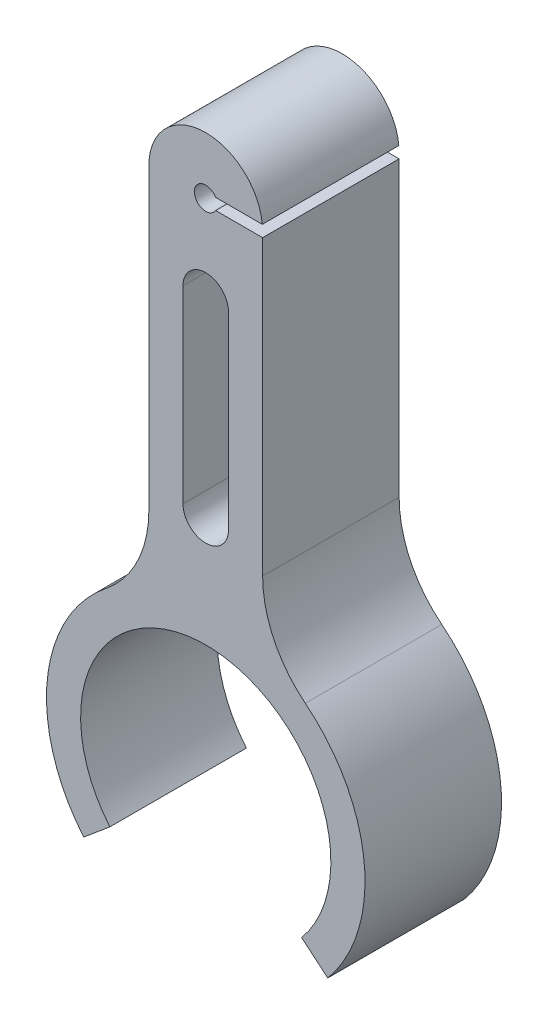
ISO-10303-21;
HEADER;
FILE_DESCRIPTION(('STEP AP214'),'2;1');
FILE_NAME('part.step','',(''),(''),'','','');
FILE_SCHEMA(('AUTOMOTIVE_DESIGN { 1 0 10303 214 1 1 1 1 }'));
ENDSEC;
DATA;
#1=APPLICATION_CONTEXT('core data for automotive mechanical design processes');
#2=APPLICATION_PROTOCOL_DEFINITION('international standard','automotive_design',2000,#1);
#3=PRODUCT_CONTEXT('',#1,'mechanical');
#4=PRODUCT('Part','Part','',(#3));
#5=PRODUCT_RELATED_PRODUCT_CATEGORY('part','',(#4));
#6=PRODUCT_DEFINITION_FORMATION('','',#4);
#7=PRODUCT_DEFINITION_CONTEXT('part definition',#1,'design');
#8=PRODUCT_DEFINITION('design','',#6,#7);
#9=PRODUCT_DEFINITION_SHAPE('','',#8);
#10=(LENGTH_UNIT() NAMED_UNIT(*) SI_UNIT(.MILLI.,.METRE.));
#11=(NAMED_UNIT(*) PLANE_ANGLE_UNIT() SI_UNIT($,.RADIAN.));
#12=(NAMED_UNIT(*) SI_UNIT($,.STERADIAN.) SOLID_ANGLE_UNIT());
#13=UNCERTAINTY_MEASURE_WITH_UNIT(LENGTH_MEASURE(1.E-05),#10,'distance_accuracy_value','');
#14=(GEOMETRIC_REPRESENTATION_CONTEXT(3) GLOBAL_UNCERTAINTY_ASSIGNED_CONTEXT((#13)) GLOBAL_UNIT_ASSIGNED_CONTEXT((#10,
#11,#12)) REPRESENTATION_CONTEXT('',''));
#15=CARTESIAN_POINT('',(0.,0.,0.));
#16=DIRECTION('',(0.,0.,1.));
#17=DIRECTION('',(1.,0.,0.));
#18=AXIS2_PLACEMENT_3D('',#15,#16,#17);
#19=CARTESIAN_POINT('',(0.,45.,12.));
#20=DIRECTION('',(0.,0.,-1.));
#21=DIRECTION('',(-1.,0.,0.));
#22=AXIS2_PLACEMENT_3D('',#19,#20,#21);
#23=CYLINDRICAL_SURFACE('',#22,2.);
#24=CARTESIAN_POINT('',(0.,45.,9.));
#25=DIRECTION('',(0.,0.,1.));
#26=DIRECTION('',(1.,0.,0.));
#27=AXIS2_PLACEMENT_3D('',#24,#25,#26);
#28=CIRCLE('',#27,2.);
#29=CARTESIAN_POINT('',(1.93649167310371,45.5,9.));
#30=VERTEX_POINT('',#29);
#31=CARTESIAN_POINT('',(1.93649167310371,44.5,9.));
#32=VERTEX_POINT('',#31);
#33=EDGE_CURVE('E201',#30,#32,#28,.T.);
#34=ORIENTED_EDGE('',*,*,#33,.T.);
#35=DIRECTION('',(0.,0.,-1.));
#36=VECTOR('',#35,1.);
#37=CARTESIAN_POINT('',(1.93649167310371,44.5,12.));
#38=LINE('',#37,#36);
#39=CARTESIAN_POINT('',(1.93649167310371,44.5,0.));
#40=VERTEX_POINT('',#39);
#41=EDGE_CURVE('E285',#32,#40,#38,.T.);
#42=ORIENTED_EDGE('',*,*,#41,.T.);
#43=CARTESIAN_POINT('',(0.,45.,0.));
#44=DIRECTION('',(0.,0.,1.));
#45=DIRECTION('',(1.,0.,0.));
#46=AXIS2_PLACEMENT_3D('',#43,#44,#45);
#47=CIRCLE('',#46,2.);
#48=CARTESIAN_POINT('',(1.93649167310371,45.5,0.));
#49=VERTEX_POINT('',#48);
#50=EDGE_CURVE('E210',#49,#40,#47,.T.);
#51=ORIENTED_EDGE('',*,*,#50,.F.);
#52=DIRECTION('',(0.,0.,-1.));
#53=VECTOR('',#52,1.);
#54=CARTESIAN_POINT('',(1.93649167310371,45.5,12.));
#55=LINE('',#54,#53);
#56=EDGE_CURVE('E170',#30,#49,#55,.T.);
#57=ORIENTED_EDGE('',*,*,#56,.F.);
#58=EDGE_LOOP('',(#34,#42,#51,#57));
#59=FACE_BOUND('',#58,.T.);
#60=ADVANCED_FACE('F35',(#59),#23,.F.);
#61=CARTESIAN_POINT('',(5.,0.,12.));
#62=DIRECTION('',(1.,0.,0.));
#63=DIRECTION('',(0.,0.,-1.));
#64=AXIS2_PLACEMENT_3D('',#61,#62,#63);
#65=PLANE('',#64);
#66=DIRECTION('',(0.,-1.,0.));
#67=VECTOR('',#66,1.);
#68=CARTESIAN_POINT('',(5.,0.,0.));
#69=LINE('',#68,#67);
#70=CARTESIAN_POINT('',(5.,44.5,0.));
#71=VERTEX_POINT('',#70);
#72=CARTESIAN_POINT('',(5.,18.7349939951952,0.));
#73=VERTEX_POINT('',#72);
#74=EDGE_CURVE('E227',#71,#73,#69,.T.);
#75=ORIENTED_EDGE('',*,*,#74,.F.);
#76=DIRECTION('',(0.,0.,1.));
#77=VECTOR('',#76,1.);
#78=CARTESIAN_POINT('',(5.,44.5,12.));
#79=LINE('',#78,#77);
#80=CARTESIAN_POINT('',(5.,44.5,12.));
#81=VERTEX_POINT('',#80);
#82=EDGE_CURVE('E288',#71,#81,#79,.T.);
#83=ORIENTED_EDGE('',*,*,#82,.T.);
#84=DIRECTION('',(0.,-1.,0.));
#85=VECTOR('',#84,1.);
#86=CARTESIAN_POINT('',(5.,0.,12.));
#87=LINE('',#86,#85);
#88=CARTESIAN_POINT('',(5.,18.7349939951952,12.));
#89=VERTEX_POINT('',#88);
#90=EDGE_CURVE('E189',#81,#89,#87,.T.);
#91=ORIENTED_EDGE('',*,*,#90,.T.);
#92=DIRECTION('',(0.,0.,-1.));
#93=VECTOR('',#92,1.);
#94=CARTESIAN_POINT('',(5.,18.7349939951952,12.));
#95=LINE('',#94,#93);
#96=EDGE_CURVE('E243',#89,#73,#95,.T.);
#97=ORIENTED_EDGE('',*,*,#96,.T.);
#98=EDGE_LOOP('',(#75,#83,#91,#97));
#99=FACE_BOUND('',#98,.T.);
#100=ADVANCED_FACE('F328',(#99),#65,.T.);
#101=CARTESIAN_POINT('',(0.,0.,12.));
#102=DIRECTION('',(0.,0.,1.));
#103=DIRECTION('',(1.,0.,0.));
#104=AXIS2_PLACEMENT_3D('',#101,#102,#103);
#105=PLANE('',#104);
#106=CARTESIAN_POINT('',(0.,20.7411148035419,12.));
#107=DIRECTION('',(0.,0.,1.));
#108=DIRECTION('',(1.,0.,0.));
#109=AXIS2_PLACEMENT_3D('',#106,#107,#108);
#110=CIRCLE('',#109,2.);
#111=CARTESIAN_POINT('',(-2.,20.7411148035419,12.));
#112=VERTEX_POINT('',#111);
#113=CARTESIAN_POINT('',(2.,20.7411148035419,12.));
#114=VERTEX_POINT('',#113);
#115=EDGE_CURVE('E231',#112,#114,#110,.T.);
#116=ORIENTED_EDGE('',*,*,#115,.F.);
#117=DIRECTION('',(0.,-1.,0.));
#118=VECTOR('',#117,1.);
#119=CARTESIAN_POINT('',(-2.,0.,12.));
#120=LINE('',#119,#118);
#121=CARTESIAN_POINT('',(-2.,37.3355820270801,12.));
#122=VERTEX_POINT('',#121);
#123=EDGE_CURVE('E296',#122,#112,#120,.T.);
#124=ORIENTED_EDGE('',*,*,#123,.F.);
#125=CARTESIAN_POINT('',(0.,37.3355820270801,12.));
#126=DIRECTION('',(0.,0.,1.));
#127=DIRECTION('',(1.,0.,0.));
#128=AXIS2_PLACEMENT_3D('',#125,#126,#127);
#129=CIRCLE('',#128,2.);
#130=CARTESIAN_POINT('',(2.,37.3355820270801,12.));
#131=VERTEX_POINT('',#130);
#132=EDGE_CURVE('E299',#131,#122,#129,.T.);
#133=ORIENTED_EDGE('',*,*,#132,.F.);
#134=DIRECTION('',(0.,-1.,0.));
#135=VECTOR('',#134,1.);
#136=CARTESIAN_POINT('',(2.,0.,12.));
#137=LINE('',#136,#135);
#138=EDGE_CURVE('E302',#131,#114,#137,.T.);
#139=ORIENTED_EDGE('',*,*,#138,.T.);
#140=EDGE_LOOP('',(#116,#124,#133,#139));
#141=FACE_BOUND('',#140,.T.);
#142=ORIENTED_EDGE('',*,*,#90,.F.);
#143=DIRECTION('',(-1.,0.,0.));
#144=VECTOR('',#143,1.);
#145=CARTESIAN_POINT('',(14.,44.5,12.));
#146=LINE('',#145,#144);
#147=CARTESIAN_POINT('',(0.866025403784439,44.5,12.));
#148=VERTEX_POINT('',#147);
#149=EDGE_CURVE('E182',#81,#148,#146,.T.);
#150=ORIENTED_EDGE('',*,*,#149,.T.);
#151=CARTESIAN_POINT('',(0.,45.,12.));
#152=DIRECTION('',(0.,0.,1.));
#153=DIRECTION('',(1.,0.,0.));
#154=AXIS2_PLACEMENT_3D('',#151,#152,#153);
#155=CIRCLE('',#154,1.);
#156=CARTESIAN_POINT('',(0.866025403784439,45.5,12.));
#157=VERTEX_POINT('',#156);
#158=EDGE_CURVE('E181',#157,#148,#155,.T.);
#159=ORIENTED_EDGE('',*,*,#158,.F.);
#160=DIRECTION('',(-1.,0.,0.));
#161=VECTOR('',#160,1.);
#162=CARTESIAN_POINT('',(14.,45.5,12.));
#163=LINE('',#162,#161);
#164=CARTESIAN_POINT('',(4.9749371855331,45.5,12.));
#165=VERTEX_POINT('',#164);
#166=EDGE_CURVE('E50',#165,#157,#163,.T.);
#167=ORIENTED_EDGE('',*,*,#166,.F.);
#168=CARTESIAN_POINT('',(0.,45.,12.));
#169=DIRECTION('',(0.,0.,1.));
#170=DIRECTION('',(1.,0.,0.));
#171=AXIS2_PLACEMENT_3D('',#168,#169,#170);
#172=CIRCLE('',#171,5.);
#173=CARTESIAN_POINT('',(-5.,45.,12.));
#174=VERTEX_POINT('',#173);
#175=EDGE_CURVE('E177',#165,#174,#172,.T.);
#176=ORIENTED_EDGE('',*,*,#175,.T.);
#177=DIRECTION('',(0.,-1.,0.));
#178=VECTOR('',#177,1.);
#179=CARTESIAN_POINT('',(-5.,0.,12.));
#180=LINE('',#179,#178);
#181=CARTESIAN_POINT('',(-5.,18.7349939951952,12.));
#182=VERTEX_POINT('',#181);
#183=EDGE_CURVE('E304',#174,#182,#180,.T.);
#184=ORIENTED_EDGE('',*,*,#183,.T.);
#185=CARTESIAN_POINT('',(-15.,18.7349939951952,12.));
#186=DIRECTION('',(0.,0.,1.));
#187=DIRECTION('',(1.,0.,0.));
#188=AXIS2_PLACEMENT_3D('',#185,#186,#187);
#189=CIRCLE('',#188,10.);
#190=CARTESIAN_POINT('',(-8.75,10.9287464971972,12.));
#191=VERTEX_POINT('',#190);
#192=EDGE_CURVE('E265',#182,#191,#189,.F.);
#193=ORIENTED_EDGE('',*,*,#192,.T.);
#194=CARTESIAN_POINT('',(0.,0.,12.));
#195=DIRECTION('',(0.,0.,1.));
#196=DIRECTION('',(1.,0.,0.));
#197=AXIS2_PLACEMENT_3D('',#194,#195,#196);
#198=CIRCLE('',#197,14.);
#199=CARTESIAN_POINT('',(-10.7246222036657,-8.99902653561153,12.));
#200=VERTEX_POINT('',#199);
#201=EDGE_CURVE('E306',#191,#200,#198,.T.);
#202=ORIENTED_EDGE('',*,*,#201,.T.);
#203=DIRECTION('',(-0.766044443118979,-0.642787609686538,0.));
#204=VECTOR('',#203,1.);
#205=CARTESIAN_POINT('',(0.,0.,12.));
#206=LINE('',#205,#204);
#207=CARTESIAN_POINT('',(-8.42648887430877,-7.07066370655192,12.));
#208=VERTEX_POINT('',#207);
#209=EDGE_CURVE('E308',#208,#200,#206,.T.);
#210=ORIENTED_EDGE('',*,*,#209,.F.);
#211=CARTESIAN_POINT('',(0.,0.,12.));
#212=DIRECTION('',(0.,0.,1.));
#213=DIRECTION('',(1.,0.,0.));
#214=AXIS2_PLACEMENT_3D('',#211,#212,#213);
#215=CIRCLE('',#214,11.);
#216=CARTESIAN_POINT('',(8.42648887430877,-7.07066370655192,12.));
#217=VERTEX_POINT('',#216);
#218=EDGE_CURVE('E311',#217,#208,#215,.T.);
#219=ORIENTED_EDGE('',*,*,#218,.F.);
#220=DIRECTION('',(0.766044443118979,-0.642787609686538,0.));
#221=VECTOR('',#220,1.);
#222=CARTESIAN_POINT('',(0.,0.,12.));
#223=LINE('',#222,#221);
#224=CARTESIAN_POINT('',(10.7246222036657,-8.99902653561153,12.));
#225=VERTEX_POINT('',#224);
#226=EDGE_CURVE('E313',#217,#225,#223,.T.);
#227=ORIENTED_EDGE('',*,*,#226,.T.);
#228=CARTESIAN_POINT('',(8.75,10.9287464971972,12.));
#229=VERTEX_POINT('',#228);
#230=EDGE_CURVE('E193',#225,#229,#198,.T.);
#231=ORIENTED_EDGE('',*,*,#230,.T.);
#232=CARTESIAN_POINT('',(15.,18.7349939951952,12.));
#233=DIRECTION('',(0.,0.,1.));
#234=DIRECTION('',(1.,0.,0.));
#235=AXIS2_PLACEMENT_3D('',#232,#233,#234);
#236=CIRCLE('',#235,10.);
#237=EDGE_CURVE('E260',#229,#89,#236,.F.);
#238=ORIENTED_EDGE('',*,*,#237,.T.);
#239=EDGE_LOOP('',(#142,#150,#159,#167,#176,#184,#193,#202,#210,#219,#227,#231,#238));
#240=FACE_BOUND('',#239,.T.);
#241=ADVANCED_FACE('F175',(#141,#240),#105,.T.);
#242=CARTESIAN_POINT('',(0.,0.,0.));
#243=DIRECTION('',(0.,0.,1.));
#244=DIRECTION('',(1.,0.,0.));
#245=AXIS2_PLACEMENT_3D('',#242,#243,#244);
#246=PLANE('',#245);
#247=CARTESIAN_POINT('',(0.,20.7411148035419,0.));
#248=DIRECTION('',(0.,0.,1.));
#249=DIRECTION('',(1.,0.,0.));
#250=AXIS2_PLACEMENT_3D('',#247,#248,#249);
#251=CIRCLE('',#250,2.);
#252=CARTESIAN_POINT('',(-2.,20.7411148035419,0.));
#253=VERTEX_POINT('',#252);
#254=CARTESIAN_POINT('',(2.,20.7411148035419,0.));
#255=VERTEX_POINT('',#254);
#256=EDGE_CURVE('E197',#253,#255,#251,.T.);
#257=ORIENTED_EDGE('',*,*,#256,.T.);
#258=DIRECTION('',(0.,-1.,0.));
#259=VECTOR('',#258,1.);
#260=CARTESIAN_POINT('',(2.,0.,0.));
#261=LINE('',#260,#259);
#262=CARTESIAN_POINT('',(2.,37.3355820270801,0.));
#263=VERTEX_POINT('',#262);
#264=EDGE_CURVE('E207',#263,#255,#261,.T.);
#265=ORIENTED_EDGE('',*,*,#264,.F.);
#266=CARTESIAN_POINT('',(0.,37.3355820270801,0.));
#267=DIRECTION('',(0.,0.,1.));
#268=DIRECTION('',(1.,0.,0.));
#269=AXIS2_PLACEMENT_3D('',#266,#267,#268);
#270=CIRCLE('',#269,2.);
#271=CARTESIAN_POINT('',(-2.,37.3355820270801,0.));
#272=VERTEX_POINT('',#271);
#273=EDGE_CURVE('E204',#263,#272,#270,.T.);
#274=ORIENTED_EDGE('',*,*,#273,.T.);
#275=DIRECTION('',(0.,-1.,0.));
#276=VECTOR('',#275,1.);
#277=CARTESIAN_POINT('',(-2.,0.,0.));
#278=LINE('',#277,#276);
#279=EDGE_CURVE('E200',#272,#253,#278,.T.);
#280=ORIENTED_EDGE('',*,*,#279,.T.);
#281=EDGE_LOOP('',(#257,#265,#274,#280));
#282=FACE_BOUND('',#281,.T.);
#283=DIRECTION('',(-1.,0.,0.));
#284=VECTOR('',#283,1.);
#285=CARTESIAN_POINT('',(14.,44.5,0.));
#286=LINE('',#285,#284);
#287=EDGE_CURVE('E278',#71,#40,#286,.T.);
#288=ORIENTED_EDGE('',*,*,#287,.F.);
#289=ORIENTED_EDGE('',*,*,#74,.T.);
#290=CARTESIAN_POINT('',(15.,18.7349939951952,0.));
#291=DIRECTION('',(0.,0.,1.));
#292=DIRECTION('',(1.,0.,0.));
#293=AXIS2_PLACEMENT_3D('',#290,#291,#292);
#294=CIRCLE('',#293,10.);
#295=CARTESIAN_POINT('',(8.75,10.9287464971972,0.));
#296=VERTEX_POINT('',#295);
#297=EDGE_CURVE('E258',#73,#296,#294,.T.);
#298=ORIENTED_EDGE('',*,*,#297,.T.);
#299=CARTESIAN_POINT('',(0.,0.,0.));
#300=DIRECTION('',(0.,0.,1.));
#301=DIRECTION('',(1.,0.,0.));
#302=AXIS2_PLACEMENT_3D('',#299,#300,#301);
#303=CIRCLE('',#302,14.);
#304=CARTESIAN_POINT('',(10.7246222036657,-8.99902653561153,0.));
#305=VERTEX_POINT('',#304);
#306=EDGE_CURVE('E219',#305,#296,#303,.T.);
#307=ORIENTED_EDGE('',*,*,#306,.F.);
#308=DIRECTION('',(0.766044443118979,-0.642787609686538,0.));
#309=VECTOR('',#308,1.);
#310=CARTESIAN_POINT('',(0.,0.,0.));
#311=LINE('',#310,#309);
#312=CARTESIAN_POINT('',(8.42648887430877,-7.07066370655192,0.));
#313=VERTEX_POINT('',#312);
#314=EDGE_CURVE('E225',#313,#305,#311,.T.);
#315=ORIENTED_EDGE('',*,*,#314,.F.);
#316=CARTESIAN_POINT('',(0.,0.,0.));
#317=DIRECTION('',(0.,0.,1.));
#318=DIRECTION('',(1.,0.,0.));
#319=AXIS2_PLACEMENT_3D('',#316,#317,#318);
#320=CIRCLE('',#319,11.);
#321=CARTESIAN_POINT('',(-8.42648887430877,-7.07066370655192,0.));
#322=VERTEX_POINT('',#321);
#323=EDGE_CURVE('E222',#313,#322,#320,.T.);
#324=ORIENTED_EDGE('',*,*,#323,.T.);
#325=DIRECTION('',(-0.766044443118979,-0.642787609686538,0.));
#326=VECTOR('',#325,1.);
#327=CARTESIAN_POINT('',(0.,0.,0.));
#328=LINE('',#327,#326);
#329=CARTESIAN_POINT('',(-10.7246222036657,-8.99902653561153,0.));
#330=VERTEX_POINT('',#329);
#331=EDGE_CURVE('E218',#322,#330,#328,.T.);
#332=ORIENTED_EDGE('',*,*,#331,.T.);
#333=CARTESIAN_POINT('',(-8.75,10.9287464971972,0.));
#334=VERTEX_POINT('',#333);
#335=EDGE_CURVE('E216',#334,#330,#303,.T.);
#336=ORIENTED_EDGE('',*,*,#335,.F.);
#337=CARTESIAN_POINT('',(-15.,18.7349939951952,0.));
#338=DIRECTION('',(0.,0.,1.));
#339=DIRECTION('',(1.,0.,0.));
#340=AXIS2_PLACEMENT_3D('',#337,#338,#339);
#341=CIRCLE('',#340,10.);
#342=CARTESIAN_POINT('',(-5.,18.7349939951952,0.));
#343=VERTEX_POINT('',#342);
#344=EDGE_CURVE('E263',#334,#343,#341,.T.);
#345=ORIENTED_EDGE('',*,*,#344,.T.);
#346=DIRECTION('',(0.,-1.,0.));
#347=VECTOR('',#346,1.);
#348=CARTESIAN_POINT('',(-5.,0.,0.));
#349=LINE('',#348,#347);
#350=CARTESIAN_POINT('',(-5.,45.,0.));
#351=VERTEX_POINT('',#350);
#352=EDGE_CURVE('E213',#351,#343,#349,.T.);
#353=ORIENTED_EDGE('',*,*,#352,.F.);
#354=CARTESIAN_POINT('',(0.,45.,0.));
#355=DIRECTION('',(0.,0.,1.));
#356=DIRECTION('',(1.,0.,0.));
#357=AXIS2_PLACEMENT_3D('',#354,#355,#356);
#358=CIRCLE('',#357,5.);
#359=CARTESIAN_POINT('',(4.9749371855331,45.5,0.));
#360=VERTEX_POINT('',#359);
#361=EDGE_CURVE('E229',#360,#351,#358,.T.);
#362=ORIENTED_EDGE('',*,*,#361,.F.);
#363=DIRECTION('',(-1.,0.,0.));
#364=VECTOR('',#363,1.);
#365=CARTESIAN_POINT('',(14.,45.5,0.));
#366=LINE('',#365,#364);
#367=EDGE_CURVE('E166',#360,#49,#366,.T.);
#368=ORIENTED_EDGE('',*,*,#367,.T.);
#369=ORIENTED_EDGE('',*,*,#50,.T.);
#370=EDGE_LOOP('',(#288,#289,#298,#307,#315,#324,#332,#336,#345,#353,#362,#368,#369));
#371=FACE_BOUND('',#370,.T.);
#372=ADVANCED_FACE('F333',(#282,#371),#246,.F.);
#373=CARTESIAN_POINT('',(0.,45.,9.));
#374=DIRECTION('',(0.,0.,1.));
#375=DIRECTION('',(1.,0.,0.));
#376=AXIS2_PLACEMENT_3D('',#373,#374,#375);
#377=PLANE('',#376);
#378=DIRECTION('',(-1.,0.,0.));
#379=VECTOR('',#378,1.);
#380=CARTESIAN_POINT('',(0.,44.5,9.));
#381=LINE('',#380,#379);
#382=CARTESIAN_POINT('',(0.866025403784439,44.5,9.));
#383=VERTEX_POINT('',#382);
#384=EDGE_CURVE('E57',#32,#383,#381,.T.);
#385=ORIENTED_EDGE('',*,*,#384,.F.);
#386=ORIENTED_EDGE('',*,*,#33,.F.);
#387=DIRECTION('',(-1.,0.,0.));
#388=VECTOR('',#387,1.);
#389=CARTESIAN_POINT('',(0.,45.5,9.));
#390=LINE('',#389,#388);
#391=CARTESIAN_POINT('',(0.866025403784439,45.5,9.));
#392=VERTEX_POINT('',#391);
#393=EDGE_CURVE('E272',#30,#392,#390,.T.);
#394=ORIENTED_EDGE('',*,*,#393,.T.);
#395=CARTESIAN_POINT('',(0.,45.,9.));
#396=DIRECTION('',(0.,0.,1.));
#397=DIRECTION('',(1.,0.,0.));
#398=AXIS2_PLACEMENT_3D('',#395,#396,#397);
#399=CIRCLE('',#398,1.);
#400=EDGE_CURVE('E270',#392,#383,#399,.T.);
#401=ORIENTED_EDGE('',*,*,#400,.T.);
#402=EDGE_LOOP('',(#385,#386,#394,#401));
#403=FACE_BOUND('',#402,.T.);
#404=ADVANCED_FACE('F276',(#403),#377,.F.);
#405=CARTESIAN_POINT('',(0.,45.,9.));
#406=DIRECTION('',(0.,0.,1.));
#407=DIRECTION('',(1.,0.,0.));
#408=AXIS2_PLACEMENT_3D('',#405,#406,#407);
#409=CYLINDRICAL_SURFACE('',#408,1.);
#410=DIRECTION('',(0.,0.,1.));
#411=VECTOR('',#410,1.);
#412=CARTESIAN_POINT('',(0.866025403784439,44.5,9.));
#413=LINE('',#412,#411);
#414=EDGE_CURVE('E11',#383,#148,#413,.T.);
#415=ORIENTED_EDGE('',*,*,#414,.F.);
#416=ORIENTED_EDGE('',*,*,#400,.F.);
#417=DIRECTION('',(0.,0.,1.));
#418=VECTOR('',#417,1.);
#419=CARTESIAN_POINT('',(0.866025403784439,45.5,9.));
#420=LINE('',#419,#418);
#421=EDGE_CURVE('E43',#392,#157,#420,.T.);
#422=ORIENTED_EDGE('',*,*,#421,.T.);
#423=ORIENTED_EDGE('',*,*,#158,.T.);
#424=EDGE_LOOP('',(#415,#416,#422,#423));
#425=FACE_BOUND('',#424,.T.);
#426=ADVANCED_FACE('F268',(#425),#409,.F.);
#427=CARTESIAN_POINT('',(-5.,0.,12.));
#428=DIRECTION('',(1.,0.,0.));
#429=DIRECTION('',(0.,0.,-1.));
#430=AXIS2_PLACEMENT_3D('',#427,#428,#429);
#431=PLANE('',#430);
#432=ORIENTED_EDGE('',*,*,#352,.T.);
#433=DIRECTION('',(0.,0.,1.));
#434=VECTOR('',#433,1.);
#435=CARTESIAN_POINT('',(-5.,18.7349939951952,12.));
#436=LINE('',#435,#434);
#437=EDGE_CURVE('E256',#343,#182,#436,.T.);
#438=ORIENTED_EDGE('',*,*,#437,.T.);
#439=ORIENTED_EDGE('',*,*,#183,.F.);
#440=DIRECTION('',(0.,0.,-1.));
#441=VECTOR('',#440,1.);
#442=CARTESIAN_POINT('',(-5.,45.,12.));
#443=LINE('',#442,#441);
#444=EDGE_CURVE('E186',#174,#351,#443,.T.);
#445=ORIENTED_EDGE('',*,*,#444,.T.);
#446=EDGE_LOOP('',(#432,#438,#439,#445));
#447=FACE_BOUND('',#446,.T.);
#448=ADVANCED_FACE('F360',(#447),#431,.F.);
#449=CARTESIAN_POINT('',(0.,0.,12.));
#450=DIRECTION('',(0.,0.,-1.));
#451=DIRECTION('',(-1.,0.,0.));
#452=AXIS2_PLACEMENT_3D('',#449,#450,#451);
#453=CYLINDRICAL_SURFACE('',#452,14.);
#454=ORIENTED_EDGE('',*,*,#201,.F.);
#455=DIRECTION('',(0.,0.,-1.));
#456=VECTOR('',#455,1.);
#457=CARTESIAN_POINT('',(-8.75,10.9287464971972,12.));
#458=LINE('',#457,#456);
#459=EDGE_CURVE('E253',#191,#334,#458,.T.);
#460=ORIENTED_EDGE('',*,*,#459,.T.);
#461=ORIENTED_EDGE('',*,*,#335,.T.);
#462=DIRECTION('',(0.,0.,-1.));
#463=VECTOR('',#462,1.);
#464=CARTESIAN_POINT('',(-10.7246222036657,-8.99902653561153,12.));
#465=LINE('',#464,#463);
#466=EDGE_CURVE('E241',#200,#330,#465,.T.);
#467=ORIENTED_EDGE('',*,*,#466,.F.);
#468=EDGE_LOOP('',(#454,#460,#461,#467));
#469=FACE_BOUND('',#468,.T.);
#470=ADVANCED_FACE('F354',(#469),#453,.T.);
#471=CARTESIAN_POINT('',(0.,0.,12.));
#472=DIRECTION('',(0.642787609686538,-0.766044443118979,0.));
#473=DIRECTION('',(0.766044443118979,0.642787609686538,0.));
#474=AXIS2_PLACEMENT_3D('',#471,#472,#473);
#475=PLANE('',#474);
#476=ORIENTED_EDGE('',*,*,#331,.F.);
#477=DIRECTION('',(0.,0.,-1.));
#478=VECTOR('',#477,1.);
#479=CARTESIAN_POINT('',(-8.42648887430877,-7.07066370655192,12.));
#480=LINE('',#479,#478);
#481=EDGE_CURVE('E239',#208,#322,#480,.T.);
#482=ORIENTED_EDGE('',*,*,#481,.F.);
#483=ORIENTED_EDGE('',*,*,#209,.T.);
#484=ORIENTED_EDGE('',*,*,#466,.T.);
#485=EDGE_LOOP('',(#476,#482,#483,#484));
#486=FACE_BOUND('',#485,.T.);
#487=ADVANCED_FACE('F349',(#486),#475,.T.);
#488=CARTESIAN_POINT('',(0.,0.,12.));
#489=DIRECTION('',(0.,0.,-1.));
#490=DIRECTION('',(-1.,0.,0.));
#491=AXIS2_PLACEMENT_3D('',#488,#489,#490);
#492=CYLINDRICAL_SURFACE('',#491,11.);
#493=ORIENTED_EDGE('',*,*,#323,.F.);
#494=DIRECTION('',(0.,0.,-1.));
#495=VECTOR('',#494,1.);
#496=CARTESIAN_POINT('',(8.42648887430877,-7.07066370655192,12.));
#497=LINE('',#496,#495);
#498=EDGE_CURVE('E237',#217,#313,#497,.T.);
#499=ORIENTED_EDGE('',*,*,#498,.F.);
#500=ORIENTED_EDGE('',*,*,#218,.T.);
#501=ORIENTED_EDGE('',*,*,#481,.T.);
#502=EDGE_LOOP('',(#493,#499,#500,#501));
#503=FACE_BOUND('',#502,.T.);
#504=ADVANCED_FACE('F345',(#503),#492,.F.);
#505=CARTESIAN_POINT('',(0.,0.,12.));
#506=DIRECTION('',(0.642787609686538,0.766044443118979,0.));
#507=DIRECTION('',(-0.766044443118979,0.642787609686538,0.));
#508=AXIS2_PLACEMENT_3D('',#505,#506,#507);
#509=PLANE('',#508);
#510=ORIENTED_EDGE('',*,*,#314,.T.);
#511=DIRECTION('',(0.,0.,-1.));
#512=VECTOR('',#511,1.);
#513=CARTESIAN_POINT('',(10.7246222036657,-8.99902653561153,12.));
#514=LINE('',#513,#512);
#515=EDGE_CURVE('E233',#225,#305,#514,.T.);
#516=ORIENTED_EDGE('',*,*,#515,.F.);
#517=ORIENTED_EDGE('',*,*,#226,.F.);
#518=ORIENTED_EDGE('',*,*,#498,.T.);
#519=EDGE_LOOP('',(#510,#516,#517,#518));
#520=FACE_BOUND('',#519,.T.);
#521=ADVANCED_FACE('F342',(#520),#509,.F.);
#522=ORIENTED_EDGE('',*,*,#306,.T.);
#523=DIRECTION('',(0.,0.,-1.));
#524=VECTOR('',#523,1.);
#525=CARTESIAN_POINT('',(8.75,10.9287464971972,12.));
#526=LINE('',#525,#524);
#527=EDGE_CURVE('E251',#296,#229,#526,.F.);
#528=ORIENTED_EDGE('',*,*,#527,.T.);
#529=ORIENTED_EDGE('',*,*,#230,.F.);
#530=ORIENTED_EDGE('',*,*,#515,.T.);
#531=EDGE_LOOP('',(#522,#528,#529,#530));
#532=FACE_BOUND('',#531,.T.);
#533=ADVANCED_FACE('F340',(#532),#453,.T.);
#534=CARTESIAN_POINT('',(0.,20.7411148035419,12.));
#535=DIRECTION('',(0.,0.,-1.));
#536=DIRECTION('',(-1.,0.,0.));
#537=AXIS2_PLACEMENT_3D('',#534,#535,#536);
#538=CYLINDRICAL_SURFACE('',#537,2.);
#539=ORIENTED_EDGE('',*,*,#256,.F.);
#540=DIRECTION('',(0.,0.,-1.));
#541=VECTOR('',#540,1.);
#542=CARTESIAN_POINT('',(-2.,20.7411148035419,12.));
#543=LINE('',#542,#541);
#544=EDGE_CURVE('E234',#112,#253,#543,.T.);
#545=ORIENTED_EDGE('',*,*,#544,.F.);
#546=ORIENTED_EDGE('',*,*,#115,.T.);
#547=DIRECTION('',(0.,0.,-1.));
#548=VECTOR('',#547,1.);
#549=CARTESIAN_POINT('',(2.,20.7411148035419,12.));
#550=LINE('',#549,#548);
#551=EDGE_CURVE('E188',#114,#255,#550,.T.);
#552=ORIENTED_EDGE('',*,*,#551,.T.);
#553=EDGE_LOOP('',(#539,#545,#546,#552));
#554=FACE_BOUND('',#553,.T.);
#555=ADVANCED_FACE('F388',(#554),#538,.F.);
#556=CARTESIAN_POINT('',(-2.,0.,12.));
#557=DIRECTION('',(1.,0.,0.));
#558=DIRECTION('',(0.,0.,-1.));
#559=AXIS2_PLACEMENT_3D('',#556,#557,#558);
#560=PLANE('',#559);
#561=ORIENTED_EDGE('',*,*,#279,.F.);
#562=DIRECTION('',(0.,0.,-1.));
#563=VECTOR('',#562,1.);
#564=CARTESIAN_POINT('',(-2.,37.3355820270801,12.));
#565=LINE('',#564,#563);
#566=EDGE_CURVE('E246',#122,#272,#565,.T.);
#567=ORIENTED_EDGE('',*,*,#566,.F.);
#568=ORIENTED_EDGE('',*,*,#123,.T.);
#569=ORIENTED_EDGE('',*,*,#544,.T.);
#570=EDGE_LOOP('',(#561,#567,#568,#569));
#571=FACE_BOUND('',#570,.T.);
#572=ADVANCED_FACE('F384',(#571),#560,.T.);
#573=CARTESIAN_POINT('',(0.,37.3355820270801,12.));
#574=DIRECTION('',(0.,0.,-1.));
#575=DIRECTION('',(-1.,0.,0.));
#576=AXIS2_PLACEMENT_3D('',#573,#574,#575);
#577=CYLINDRICAL_SURFACE('',#576,2.);
#578=ORIENTED_EDGE('',*,*,#273,.F.);
#579=DIRECTION('',(0.,0.,-1.));
#580=VECTOR('',#579,1.);
#581=CARTESIAN_POINT('',(2.,37.3355820270801,12.));
#582=LINE('',#581,#580);
#583=EDGE_CURVE('E191',#131,#263,#582,.T.);
#584=ORIENTED_EDGE('',*,*,#583,.F.);
#585=ORIENTED_EDGE('',*,*,#132,.T.);
#586=ORIENTED_EDGE('',*,*,#566,.T.);
#587=EDGE_LOOP('',(#578,#584,#585,#586));
#588=FACE_BOUND('',#587,.T.);
#589=ADVANCED_FACE('F380',(#588),#577,.F.);
#590=CARTESIAN_POINT('',(2.,0.,12.));
#591=DIRECTION('',(1.,0.,0.));
#592=DIRECTION('',(0.,0.,-1.));
#593=AXIS2_PLACEMENT_3D('',#590,#591,#592);
#594=PLANE('',#593);
#595=ORIENTED_EDGE('',*,*,#264,.T.);
#596=ORIENTED_EDGE('',*,*,#551,.F.);
#597=ORIENTED_EDGE('',*,*,#138,.F.);
#598=ORIENTED_EDGE('',*,*,#583,.T.);
#599=EDGE_LOOP('',(#595,#596,#597,#598));
#600=FACE_BOUND('',#599,.T.);
#601=ADVANCED_FACE('F377',(#600),#594,.F.);
#602=CARTESIAN_POINT('',(0.,45.,12.));
#603=DIRECTION('',(0.,0.,-1.));
#604=DIRECTION('',(-1.,0.,0.));
#605=AXIS2_PLACEMENT_3D('',#602,#603,#604);
#606=CYLINDRICAL_SURFACE('',#605,5.);
#607=ORIENTED_EDGE('',*,*,#175,.F.);
#608=DIRECTION('',(0.,0.,-1.));
#609=VECTOR('',#608,1.);
#610=CARTESIAN_POINT('',(4.9749371855331,45.5,12.));
#611=LINE('',#610,#609);
#612=EDGE_CURVE('E163',#165,#360,#611,.T.);
#613=ORIENTED_EDGE('',*,*,#612,.T.);
#614=ORIENTED_EDGE('',*,*,#361,.T.);
#615=ORIENTED_EDGE('',*,*,#444,.F.);
#616=EDGE_LOOP('',(#607,#613,#614,#615));
#617=FACE_BOUND('',#616,.T.);
#618=ADVANCED_FACE('F184',(#617),#606,.T.);
#619=CARTESIAN_POINT('',(15.,18.7349939951952,12.));
#620=DIRECTION('',(0.,0.,-1.));
#621=DIRECTION('',(-1.,0.,0.));
#622=AXIS2_PLACEMENT_3D('',#619,#620,#621);
#623=CYLINDRICAL_SURFACE('',#622,10.);
#624=ORIENTED_EDGE('',*,*,#237,.F.);
#625=ORIENTED_EDGE('',*,*,#527,.F.);
#626=ORIENTED_EDGE('',*,*,#297,.F.);
#627=ORIENTED_EDGE('',*,*,#96,.F.);
#628=EDGE_LOOP('',(#624,#625,#626,#627));
#629=FACE_BOUND('',#628,.T.);
#630=ADVANCED_FACE('F324',(#629),#623,.F.);
#631=CARTESIAN_POINT('',(-15.,18.7349939951952,12.));
#632=DIRECTION('',(0.,0.,-1.));
#633=DIRECTION('',(-1.,0.,0.));
#634=AXIS2_PLACEMENT_3D('',#631,#632,#633);
#635=CYLINDRICAL_SURFACE('',#634,10.);
#636=ORIENTED_EDGE('',*,*,#192,.F.);
#637=ORIENTED_EDGE('',*,*,#437,.F.);
#638=ORIENTED_EDGE('',*,*,#344,.F.);
#639=ORIENTED_EDGE('',*,*,#459,.F.);
#640=EDGE_LOOP('',(#636,#637,#638,#639));
#641=FACE_BOUND('',#640,.T.);
#642=ADVANCED_FACE('F37',(#641),#635,.F.);
#643=CARTESIAN_POINT('',(14.,45.5,12.));
#644=DIRECTION('',(0.,1.,0.));
#645=DIRECTION('',(0.,0.,1.));
#646=AXIS2_PLACEMENT_3D('',#643,#644,#645);
#647=PLANE('',#646);
#648=ORIENTED_EDGE('',*,*,#166,.T.);
#649=ORIENTED_EDGE('',*,*,#421,.F.);
#650=ORIENTED_EDGE('',*,*,#393,.F.);
#651=ORIENTED_EDGE('',*,*,#56,.T.);
#652=ORIENTED_EDGE('',*,*,#367,.F.);
#653=ORIENTED_EDGE('',*,*,#612,.F.);
#654=EDGE_LOOP('',(#648,#649,#650,#651,#652,#653));
#655=FACE_BOUND('',#654,.T.);
#656=ADVANCED_FACE('F164',(#655),#647,.F.);
#657=CARTESIAN_POINT('',(14.,44.5,12.));
#658=DIRECTION('',(0.,1.,0.));
#659=DIRECTION('',(0.,0.,1.));
#660=AXIS2_PLACEMENT_3D('',#657,#658,#659);
#661=PLANE('',#660);
#662=ORIENTED_EDGE('',*,*,#287,.T.);
#663=ORIENTED_EDGE('',*,*,#41,.F.);
#664=ORIENTED_EDGE('',*,*,#384,.T.);
#665=ORIENTED_EDGE('',*,*,#414,.T.);
#666=ORIENTED_EDGE('',*,*,#149,.F.);
#667=ORIENTED_EDGE('',*,*,#82,.F.);
#668=EDGE_LOOP('',(#662,#663,#664,#665,#666,#667));
#669=FACE_BOUND('',#668,.T.);
#670=ADVANCED_FACE('F336',(#669),#661,.T.);
#671=CLOSED_SHELL('',(#60,#100,#241,#372,#404,#426,#448,#470,#487,#504,#521,#533,#555,#572,#589,
#601,#618,#630,#642,#656,#670));
#672=MANIFOLD_SOLID_BREP('B2',#671);
#673=ADVANCED_BREP_SHAPE_REPRESENTATION('',(#18,#672),#14);
#674=SHAPE_DEFINITION_REPRESENTATION(#9,#673);
ENDSEC;
END-ISO-10303-21;
